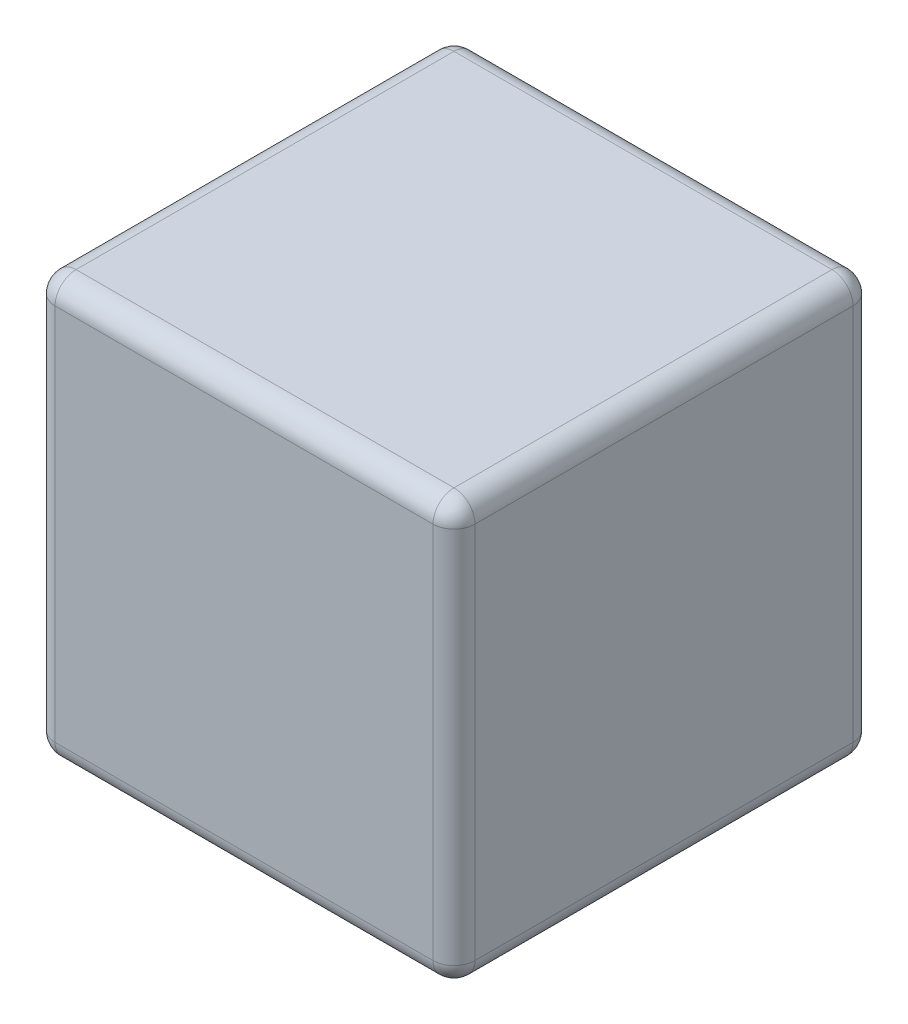
ISO-10303-21;
HEADER;
FILE_DESCRIPTION(('STEP AP214'),'2;1');
FILE_NAME('part.step','',(''),(''),'','','');
FILE_SCHEMA(('AUTOMOTIVE_DESIGN { 1 0 10303 214 1 1 1 1 }'));
ENDSEC;
DATA;
#1=APPLICATION_CONTEXT('core data for automotive mechanical design processes');
#2=APPLICATION_PROTOCOL_DEFINITION('international standard','automotive_design',2000,#1);
#3=PRODUCT_CONTEXT('',#1,'mechanical');
#4=PRODUCT('Part','Part','',(#3));
#5=PRODUCT_RELATED_PRODUCT_CATEGORY('part','',(#4));
#6=PRODUCT_DEFINITION_FORMATION('','',#4);
#7=PRODUCT_DEFINITION_CONTEXT('part definition',#1,'design');
#8=PRODUCT_DEFINITION('design','',#6,#7);
#9=PRODUCT_DEFINITION_SHAPE('','',#8);
#10=(LENGTH_UNIT() NAMED_UNIT(*) SI_UNIT(.MILLI.,.METRE.));
#11=(NAMED_UNIT(*) PLANE_ANGLE_UNIT() SI_UNIT($,.RADIAN.));
#12=(NAMED_UNIT(*) SI_UNIT($,.STERADIAN.) SOLID_ANGLE_UNIT());
#13=UNCERTAINTY_MEASURE_WITH_UNIT(LENGTH_MEASURE(1.E-05),#10,'distance_accuracy_value','');
#14=(GEOMETRIC_REPRESENTATION_CONTEXT(3) GLOBAL_UNCERTAINTY_ASSIGNED_CONTEXT((#13)) GLOBAL_UNIT_ASSIGNED_CONTEXT((#10,
#11,#12)) REPRESENTATION_CONTEXT('',''));
#15=CARTESIAN_POINT('',(0.,0.,0.));
#16=DIRECTION('',(0.,0.,1.));
#17=DIRECTION('',(1.,0.,0.));
#18=AXIS2_PLACEMENT_3D('',#15,#16,#17);
#19=CARTESIAN_POINT('',(0.,0.,10.));
#20=DIRECTION('',(1.,0.,0.));
#21=DIRECTION('',(0.,0.,-1.));
#22=AXIS2_PLACEMENT_3D('',#19,#20,#21);
#23=PLANE('',#22);
#24=DIRECTION('',(0.,-1.,0.));
#25=VECTOR('',#24,1.);
#26=CARTESIAN_POINT('',(0.,0.,0.5));
#27=LINE('',#26,#25);
#28=CARTESIAN_POINT('',(0.,9.5,0.5));
#29=VERTEX_POINT('',#28);
#30=CARTESIAN_POINT('',(0.,0.5,0.5));
#31=VERTEX_POINT('',#30);
#32=EDGE_CURVE('E277',#29,#31,#27,.T.);
#33=ORIENTED_EDGE('',*,*,#32,.T.);
#34=DIRECTION('',(0.,0.,-1.));
#35=VECTOR('',#34,1.);
#36=CARTESIAN_POINT('',(0.,0.5,10.));
#37=LINE('',#36,#35);
#38=CARTESIAN_POINT('',(0.,0.5,9.5));
#39=VERTEX_POINT('',#38);
#40=EDGE_CURVE('E221',#31,#39,#37,.F.);
#41=ORIENTED_EDGE('',*,*,#40,.T.);
#42=DIRECTION('',(0.,-1.,0.));
#43=VECTOR('',#42,1.);
#44=CARTESIAN_POINT('',(0.,0.,9.5));
#45=LINE('',#44,#43);
#46=CARTESIAN_POINT('',(0.,9.5,9.5));
#47=VERTEX_POINT('',#46);
#48=EDGE_CURVE('E226',#39,#47,#45,.F.);
#49=ORIENTED_EDGE('',*,*,#48,.T.);
#50=DIRECTION('',(0.,0.,-1.));
#51=VECTOR('',#50,1.);
#52=CARTESIAN_POINT('',(0.,9.5,10.));
#53=LINE('',#52,#51);
#54=EDGE_CURVE('E309',#47,#29,#53,.T.);
#55=ORIENTED_EDGE('',*,*,#54,.T.);
#56=EDGE_LOOP('',(#33,#41,#49,#55));
#57=FACE_BOUND('',#56,.T.);
#58=ADVANCED_FACE('F35',(#57),#23,.F.);
#59=CARTESIAN_POINT('',(0.,0.,10.));
#60=DIRECTION('',(0.,1.,0.));
#61=DIRECTION('',(0.,0.,1.));
#62=AXIS2_PLACEMENT_3D('',#59,#60,#61);
#63=PLANE('',#62);
#64=DIRECTION('',(1.,0.,0.));
#65=VECTOR('',#64,1.);
#66=CARTESIAN_POINT('',(0.,0.,9.5));
#67=LINE('',#66,#65);
#68=CARTESIAN_POINT('',(9.5,0.,9.5));
#69=VERTEX_POINT('',#68);
#70=CARTESIAN_POINT('',(0.5,0.,9.5));
#71=VERTEX_POINT('',#70);
#72=EDGE_CURVE('E133',#69,#71,#67,.F.);
#73=ORIENTED_EDGE('',*,*,#72,.T.);
#74=DIRECTION('',(0.,0.,-1.));
#75=VECTOR('',#74,1.);
#76=CARTESIAN_POINT('',(0.5,0.,10.));
#77=LINE('',#76,#75);
#78=CARTESIAN_POINT('',(0.5,0.,0.5));
#79=VERTEX_POINT('',#78);
#80=EDGE_CURVE('E129',#71,#79,#77,.T.);
#81=ORIENTED_EDGE('',*,*,#80,.T.);
#82=DIRECTION('',(1.,0.,0.));
#83=VECTOR('',#82,1.);
#84=CARTESIAN_POINT('',(10.,0.,0.5));
#85=LINE('',#84,#83);
#86=CARTESIAN_POINT('',(9.5,0.,0.5));
#87=VERTEX_POINT('',#86);
#88=EDGE_CURVE('E123',#79,#87,#85,.T.);
#89=ORIENTED_EDGE('',*,*,#88,.T.);
#90=DIRECTION('',(0.,0.,-1.));
#91=VECTOR('',#90,1.);
#92=CARTESIAN_POINT('',(9.5,0.,10.));
#93=LINE('',#92,#91);
#94=EDGE_CURVE('E126',#87,#69,#93,.F.);
#95=ORIENTED_EDGE('',*,*,#94,.T.);
#96=EDGE_LOOP('',(#73,#81,#89,#95));
#97=FACE_BOUND('',#96,.T.);
#98=ADVANCED_FACE('F125',(#97),#63,.F.);
#99=CARTESIAN_POINT('',(10.,0.,10.));
#100=DIRECTION('',(-1.,0.,0.));
#101=DIRECTION('',(0.,0.,1.));
#102=AXIS2_PLACEMENT_3D('',#99,#100,#101);
#103=PLANE('',#102);
#104=DIRECTION('',(0.,1.,0.));
#105=VECTOR('',#104,1.);
#106=CARTESIAN_POINT('',(10.,0.,9.5));
#107=LINE('',#106,#105);
#108=CARTESIAN_POINT('',(10.,9.5,9.5));
#109=VERTEX_POINT('',#108);
#110=CARTESIAN_POINT('',(10.,0.5,9.5));
#111=VERTEX_POINT('',#110);
#112=EDGE_CURVE('E245',#109,#111,#107,.F.);
#113=ORIENTED_EDGE('',*,*,#112,.T.);
#114=DIRECTION('',(0.,0.,-1.));
#115=VECTOR('',#114,1.);
#116=CARTESIAN_POINT('',(10.,0.5,10.));
#117=LINE('',#116,#115);
#118=CARTESIAN_POINT('',(10.,0.5,0.5));
#119=VERTEX_POINT('',#118);
#120=EDGE_CURVE('E247',#111,#119,#117,.T.);
#121=ORIENTED_EDGE('',*,*,#120,.T.);
#122=DIRECTION('',(0.,1.,0.));
#123=VECTOR('',#122,1.);
#124=CARTESIAN_POINT('',(10.,10.,0.5));
#125=LINE('',#124,#123);
#126=CARTESIAN_POINT('',(10.,9.5,0.5));
#127=VERTEX_POINT('',#126);
#128=EDGE_CURVE('E243',#119,#127,#125,.T.);
#129=ORIENTED_EDGE('',*,*,#128,.T.);
#130=DIRECTION('',(0.,0.,-1.));
#131=VECTOR('',#130,1.);
#132=CARTESIAN_POINT('',(10.,9.5,10.));
#133=LINE('',#132,#131);
#134=EDGE_CURVE('E241',#127,#109,#133,.F.);
#135=ORIENTED_EDGE('',*,*,#134,.T.);
#136=EDGE_LOOP('',(#113,#121,#129,#135));
#137=FACE_BOUND('',#136,.T.);
#138=ADVANCED_FACE('F297',(#137),#103,.F.);
#139=CARTESIAN_POINT('',(0.,10.,10.));
#140=DIRECTION('',(0.,-1.,0.));
#141=DIRECTION('',(0.,0.,-1.));
#142=AXIS2_PLACEMENT_3D('',#139,#140,#141);
#143=PLANE('',#142);
#144=DIRECTION('',(-1.,0.,0.));
#145=VECTOR('',#144,1.);
#146=CARTESIAN_POINT('',(0.,10.,9.5));
#147=LINE('',#146,#145);
#148=CARTESIAN_POINT('',(0.5,10.,9.5));
#149=VERTEX_POINT('',#148);
#150=CARTESIAN_POINT('',(9.5,10.,9.5));
#151=VERTEX_POINT('',#150);
#152=EDGE_CURVE('E44',#149,#151,#147,.F.);
#153=ORIENTED_EDGE('',*,*,#152,.T.);
#154=DIRECTION('',(0.,0.,-1.));
#155=VECTOR('',#154,1.);
#156=CARTESIAN_POINT('',(9.5,10.,10.));
#157=LINE('',#156,#155);
#158=CARTESIAN_POINT('',(9.5,10.,0.5));
#159=VERTEX_POINT('',#158);
#160=EDGE_CURVE('E11',#151,#159,#157,.T.);
#161=ORIENTED_EDGE('',*,*,#160,.T.);
#162=DIRECTION('',(-1.,0.,0.));
#163=VECTOR('',#162,1.);
#164=CARTESIAN_POINT('',(0.,10.,0.5));
#165=LINE('',#164,#163);
#166=CARTESIAN_POINT('',(0.5,10.,0.5));
#167=VERTEX_POINT('',#166);
#168=EDGE_CURVE('E250',#159,#167,#165,.T.);
#169=ORIENTED_EDGE('',*,*,#168,.T.);
#170=DIRECTION('',(0.,0.,-1.));
#171=VECTOR('',#170,1.);
#172=CARTESIAN_POINT('',(0.5,10.,10.));
#173=LINE('',#172,#171);
#174=EDGE_CURVE('E55',#167,#149,#173,.F.);
#175=ORIENTED_EDGE('',*,*,#174,.T.);
#176=EDGE_LOOP('',(#153,#161,#169,#175));
#177=FACE_BOUND('',#176,.T.);
#178=ADVANCED_FACE('F501',(#177),#143,.F.);
#179=CARTESIAN_POINT('',(0.,0.,10.));
#180=DIRECTION('',(0.,0.,-1.));
#181=DIRECTION('',(-1.,0.,0.));
#182=AXIS2_PLACEMENT_3D('',#179,#180,#181);
#183=PLANE('',#182);
#184=DIRECTION('',(0.,-1.,0.));
#185=VECTOR('',#184,1.);
#186=CARTESIAN_POINT('',(0.5,0.,10.));
#187=LINE('',#186,#185);
#188=CARTESIAN_POINT('',(0.5,9.5,10.));
#189=VERTEX_POINT('',#188);
#190=CARTESIAN_POINT('',(0.5,0.5,10.));
#191=VERTEX_POINT('',#190);
#192=EDGE_CURVE('E223',#189,#191,#187,.T.);
#193=ORIENTED_EDGE('',*,*,#192,.T.);
#194=DIRECTION('',(1.,0.,0.));
#195=VECTOR('',#194,1.);
#196=CARTESIAN_POINT('',(0.,0.5,10.));
#197=LINE('',#196,#195);
#198=CARTESIAN_POINT('',(9.5,0.5,10.));
#199=VERTEX_POINT('',#198);
#200=EDGE_CURVE('E231',#191,#199,#197,.T.);
#201=ORIENTED_EDGE('',*,*,#200,.T.);
#202=DIRECTION('',(0.,1.,0.));
#203=VECTOR('',#202,1.);
#204=CARTESIAN_POINT('',(9.5,0.,10.));
#205=LINE('',#204,#203);
#206=CARTESIAN_POINT('',(9.5,9.5,10.));
#207=VERTEX_POINT('',#206);
#208=EDGE_CURVE('E220',#199,#207,#205,.T.);
#209=ORIENTED_EDGE('',*,*,#208,.T.);
#210=DIRECTION('',(-1.,0.,0.));
#211=VECTOR('',#210,1.);
#212=CARTESIAN_POINT('',(0.,9.5,10.));
#213=LINE('',#212,#211);
#214=EDGE_CURVE('E217',#207,#189,#213,.T.);
#215=ORIENTED_EDGE('',*,*,#214,.T.);
#216=EDGE_LOOP('',(#193,#201,#209,#215));
#217=FACE_BOUND('',#216,.T.);
#218=ADVANCED_FACE('F493',(#217),#183,.F.);
#219=CARTESIAN_POINT('',(0.,0.,0.));
#220=DIRECTION('',(0.,0.,-1.));
#221=DIRECTION('',(-1.,0.,0.));
#222=AXIS2_PLACEMENT_3D('',#219,#220,#221);
#223=PLANE('',#222);
#224=DIRECTION('',(0.,1.,0.));
#225=VECTOR('',#224,1.);
#226=CARTESIAN_POINT('',(9.5,0.,0.));
#227=LINE('',#226,#225);
#228=CARTESIAN_POINT('',(9.5,9.5,0.));
#229=VERTEX_POINT('',#228);
#230=CARTESIAN_POINT('',(9.5,0.5,0.));
#231=VERTEX_POINT('',#230);
#232=EDGE_CURVE('E236',#229,#231,#227,.F.);
#233=ORIENTED_EDGE('',*,*,#232,.T.);
#234=DIRECTION('',(1.,0.,0.));
#235=VECTOR('',#234,1.);
#236=CARTESIAN_POINT('',(0.,0.5,0.));
#237=LINE('',#236,#235);
#238=CARTESIAN_POINT('',(0.5,0.5,0.));
#239=VERTEX_POINT('',#238);
#240=EDGE_CURVE('E156',#231,#239,#237,.F.);
#241=ORIENTED_EDGE('',*,*,#240,.T.);
#242=DIRECTION('',(0.,-1.,0.));
#243=VECTOR('',#242,1.);
#244=CARTESIAN_POINT('',(0.5,10.,0.));
#245=LINE('',#244,#243);
#246=CARTESIAN_POINT('',(0.5,9.5,0.));
#247=VERTEX_POINT('',#246);
#248=EDGE_CURVE('E238',#239,#247,#245,.F.);
#249=ORIENTED_EDGE('',*,*,#248,.T.);
#250=DIRECTION('',(-1.,0.,0.));
#251=VECTOR('',#250,1.);
#252=CARTESIAN_POINT('',(10.,9.5,0.));
#253=LINE('',#252,#251);
#254=EDGE_CURVE('E234',#247,#229,#253,.F.);
#255=ORIENTED_EDGE('',*,*,#254,.T.);
#256=EDGE_LOOP('',(#233,#241,#249,#255));
#257=FACE_BOUND('',#256,.T.);
#258=ADVANCED_FACE('F292',(#257),#223,.T.);
#259=CARTESIAN_POINT('',(9.5,9.5,10.));
#260=DIRECTION('',(0.,0.,-1.));
#261=DIRECTION('',(-1.,0.,0.));
#262=AXIS2_PLACEMENT_3D('',#259,#260,#261);
#263=CYLINDRICAL_SURFACE('',#262,0.5);
#264=CARTESIAN_POINT('',(9.5,9.5,9.5));
#265=DIRECTION('',(0.,0.,1.));
#266=DIRECTION('',(1.,0.,0.));
#267=AXIS2_PLACEMENT_3D('',#264,#265,#266);
#268=CIRCLE('',#267,0.5);
#269=EDGE_CURVE('E39',#109,#151,#268,.T.);
#270=ORIENTED_EDGE('',*,*,#269,.F.);
#271=ORIENTED_EDGE('',*,*,#134,.F.);
#272=CARTESIAN_POINT('',(9.5,9.5,0.5));
#273=DIRECTION('',(0.,0.,-1.));
#274=DIRECTION('',(-1.,0.,0.));
#275=AXIS2_PLACEMENT_3D('',#272,#273,#274);
#276=CIRCLE('',#275,0.5);
#277=EDGE_CURVE('E197',#159,#127,#276,.T.);
#278=ORIENTED_EDGE('',*,*,#277,.F.);
#279=ORIENTED_EDGE('',*,*,#160,.F.);
#280=EDGE_LOOP('',(#270,#271,#278,#279));
#281=FACE_BOUND('',#280,.T.);
#282=ADVANCED_FACE('F37',(#281),#263,.T.);
#283=CARTESIAN_POINT('',(9.5,9.5,9.5));
#284=DIRECTION('',(0.,0.,1.));
#285=DIRECTION('',(1.,0.,0.));
#286=AXIS2_PLACEMENT_3D('',#283,#284,#285);
#287=SPHERICAL_SURFACE('',#286,0.5);
#288=CARTESIAN_POINT('',(9.5,9.5,9.5));
#289=DIRECTION('',(0.,1.,0.));
#290=DIRECTION('',(0.,0.,1.));
#291=AXIS2_PLACEMENT_3D('',#288,#289,#290);
#292=CIRCLE('',#291,0.5);
#293=EDGE_CURVE('E192',#109,#207,#292,.F.);
#294=ORIENTED_EDGE('',*,*,#293,.F.);
#295=ORIENTED_EDGE('',*,*,#269,.T.);
#296=CARTESIAN_POINT('',(9.5,9.5,9.5));
#297=DIRECTION('',(1.,0.,0.));
#298=DIRECTION('',(0.,0.,-1.));
#299=AXIS2_PLACEMENT_3D('',#296,#297,#298);
#300=CIRCLE('',#299,0.5);
#301=EDGE_CURVE('E195',#207,#151,#300,.F.);
#302=ORIENTED_EDGE('',*,*,#301,.F.);
#303=EDGE_LOOP('',(#294,#295,#302));
#304=FACE_BOUND('',#303,.T.);
#305=ADVANCED_FACE('F208',(#304),#287,.T.);
#306=CARTESIAN_POINT('',(9.5,9.5,0.5));
#307=DIRECTION('',(0.,0.,1.));
#308=DIRECTION('',(1.,0.,0.));
#309=AXIS2_PLACEMENT_3D('',#306,#307,#308);
#310=SPHERICAL_SURFACE('',#309,0.5);
#311=CARTESIAN_POINT('',(9.5,9.5,0.5));
#312=DIRECTION('',(1.,0.,0.));
#313=DIRECTION('',(0.,0.,-1.));
#314=AXIS2_PLACEMENT_3D('',#311,#312,#313);
#315=CIRCLE('',#314,0.5);
#316=EDGE_CURVE('E186',#159,#229,#315,.F.);
#317=ORIENTED_EDGE('',*,*,#316,.F.);
#318=ORIENTED_EDGE('',*,*,#277,.T.);
#319=CARTESIAN_POINT('',(9.5,9.5,0.5));
#320=DIRECTION('',(0.,1.,0.));
#321=DIRECTION('',(0.,0.,1.));
#322=AXIS2_PLACEMENT_3D('',#319,#320,#321);
#323=CIRCLE('',#322,0.5);
#324=EDGE_CURVE('E189',#229,#127,#323,.F.);
#325=ORIENTED_EDGE('',*,*,#324,.F.);
#326=EDGE_LOOP('',(#317,#318,#325));
#327=FACE_BOUND('',#326,.T.);
#328=ADVANCED_FACE('F321',(#327),#310,.T.);
#329=CARTESIAN_POINT('',(0.,9.5,9.5));
#330=DIRECTION('',(-1.,0.,0.));
#331=DIRECTION('',(0.,0.,1.));
#332=AXIS2_PLACEMENT_3D('',#329,#330,#331);
#333=CYLINDRICAL_SURFACE('',#332,0.5);
#334=ORIENTED_EDGE('',*,*,#301,.T.);
#335=ORIENTED_EDGE('',*,*,#152,.F.);
#336=CARTESIAN_POINT('',(0.5,9.5,9.5));
#337=DIRECTION('',(-1.,0.,0.));
#338=DIRECTION('',(0.,0.,1.));
#339=AXIS2_PLACEMENT_3D('',#336,#337,#338);
#340=CIRCLE('',#339,0.5);
#341=EDGE_CURVE('E180',#189,#149,#340,.T.);
#342=ORIENTED_EDGE('',*,*,#341,.F.);
#343=ORIENTED_EDGE('',*,*,#214,.F.);
#344=EDGE_LOOP('',(#334,#335,#342,#343));
#345=FACE_BOUND('',#344,.T.);
#346=ADVANCED_FACE('F214',(#345),#333,.T.);
#347=CARTESIAN_POINT('',(9.5,0.,9.5));
#348=DIRECTION('',(0.,1.,0.));
#349=DIRECTION('',(0.,0.,1.));
#350=AXIS2_PLACEMENT_3D('',#347,#348,#349);
#351=CYLINDRICAL_SURFACE('',#350,0.5);
#352=ORIENTED_EDGE('',*,*,#293,.T.);
#353=ORIENTED_EDGE('',*,*,#208,.F.);
#354=CARTESIAN_POINT('',(9.5,0.5,9.5));
#355=DIRECTION('',(0.,-1.,0.));
#356=DIRECTION('',(0.,0.,-1.));
#357=AXIS2_PLACEMENT_3D('',#354,#355,#356);
#358=CIRCLE('',#357,0.5);
#359=EDGE_CURVE('E177',#111,#199,#358,.T.);
#360=ORIENTED_EDGE('',*,*,#359,.F.);
#361=ORIENTED_EDGE('',*,*,#112,.F.);
#362=EDGE_LOOP('',(#352,#353,#360,#361));
#363=FACE_BOUND('',#362,.T.);
#364=ADVANCED_FACE('F301',(#363),#351,.T.);
#365=CARTESIAN_POINT('',(9.5,0.5,10.));
#366=DIRECTION('',(0.,0.,-1.));
#367=DIRECTION('',(-1.,0.,0.));
#368=AXIS2_PLACEMENT_3D('',#365,#366,#367);
#369=CYLINDRICAL_SURFACE('',#368,0.5);
#370=CARTESIAN_POINT('',(9.5,0.5,0.5));
#371=DIRECTION('',(0.,0.,-1.));
#372=DIRECTION('',(-1.,0.,0.));
#373=AXIS2_PLACEMENT_3D('',#370,#371,#372);
#374=CIRCLE('',#373,0.5);
#375=EDGE_CURVE('E140',#119,#87,#374,.T.);
#376=ORIENTED_EDGE('',*,*,#375,.F.);
#377=ORIENTED_EDGE('',*,*,#120,.F.);
#378=CARTESIAN_POINT('',(9.5,0.5,9.5));
#379=DIRECTION('',(0.,0.,1.));
#380=DIRECTION('',(1.,0.,0.));
#381=AXIS2_PLACEMENT_3D('',#378,#379,#380);
#382=CIRCLE('',#381,0.5);
#383=EDGE_CURVE('E143',#69,#111,#382,.T.);
#384=ORIENTED_EDGE('',*,*,#383,.F.);
#385=ORIENTED_EDGE('',*,*,#94,.F.);
#386=EDGE_LOOP('',(#376,#377,#384,#385));
#387=FACE_BOUND('',#386,.T.);
#388=ADVANCED_FACE('F138',(#387),#369,.T.);
#389=CARTESIAN_POINT('',(9.5,0.,0.5));
#390=DIRECTION('',(0.,-1.,0.));
#391=DIRECTION('',(0.,0.,-1.));
#392=AXIS2_PLACEMENT_3D('',#389,#390,#391);
#393=CYLINDRICAL_SURFACE('',#392,0.5);
#394=ORIENTED_EDGE('',*,*,#324,.T.);
#395=ORIENTED_EDGE('',*,*,#128,.F.);
#396=CARTESIAN_POINT('',(9.5,0.5,0.5));
#397=DIRECTION('',(0.,-1.,0.));
#398=DIRECTION('',(0.,0.,-1.));
#399=AXIS2_PLACEMENT_3D('',#396,#397,#398);
#400=CIRCLE('',#399,0.5);
#401=EDGE_CURVE('E152',#231,#119,#400,.T.);
#402=ORIENTED_EDGE('',*,*,#401,.F.);
#403=ORIENTED_EDGE('',*,*,#232,.F.);
#404=EDGE_LOOP('',(#394,#395,#402,#403));
#405=FACE_BOUND('',#404,.T.);
#406=ADVANCED_FACE('F295',(#405),#393,.T.);
#407=CARTESIAN_POINT('',(0.,9.5,0.5));
#408=DIRECTION('',(1.,0.,0.));
#409=DIRECTION('',(0.,0.,-1.));
#410=AXIS2_PLACEMENT_3D('',#407,#408,#409);
#411=CYLINDRICAL_SURFACE('',#410,0.5);
#412=ORIENTED_EDGE('',*,*,#316,.T.);
#413=ORIENTED_EDGE('',*,*,#254,.F.);
#414=CARTESIAN_POINT('',(0.5,9.5,0.5));
#415=DIRECTION('',(-1.,0.,0.));
#416=DIRECTION('',(0.,0.,1.));
#417=AXIS2_PLACEMENT_3D('',#414,#415,#416);
#418=CIRCLE('',#417,0.5);
#419=EDGE_CURVE('E172',#167,#247,#418,.T.);
#420=ORIENTED_EDGE('',*,*,#419,.F.);
#421=ORIENTED_EDGE('',*,*,#168,.F.);
#422=EDGE_LOOP('',(#412,#413,#420,#421));
#423=FACE_BOUND('',#422,.T.);
#424=ADVANCED_FACE('F320',(#423),#411,.T.);
#425=CARTESIAN_POINT('',(0.5,9.5,10.));
#426=DIRECTION('',(0.,0.,-1.));
#427=DIRECTION('',(-1.,0.,0.));
#428=AXIS2_PLACEMENT_3D('',#425,#426,#427);
#429=CYLINDRICAL_SURFACE('',#428,0.5);
#430=CARTESIAN_POINT('',(0.5,9.5,9.5));
#431=DIRECTION('',(0.,0.,1.));
#432=DIRECTION('',(1.,0.,0.));
#433=AXIS2_PLACEMENT_3D('',#430,#431,#432);
#434=CIRCLE('',#433,0.5);
#435=EDGE_CURVE('E183',#149,#47,#434,.T.);
#436=ORIENTED_EDGE('',*,*,#435,.F.);
#437=ORIENTED_EDGE('',*,*,#174,.F.);
#438=CARTESIAN_POINT('',(0.5,9.5,0.5));
#439=DIRECTION('',(0.,0.,-1.));
#440=DIRECTION('',(-1.,0.,0.));
#441=AXIS2_PLACEMENT_3D('',#438,#439,#440);
#442=CIRCLE('',#441,0.5);
#443=EDGE_CURVE('E169',#29,#167,#442,.T.);
#444=ORIENTED_EDGE('',*,*,#443,.F.);
#445=ORIENTED_EDGE('',*,*,#54,.F.);
#446=EDGE_LOOP('',(#436,#437,#444,#445));
#447=FACE_BOUND('',#446,.T.);
#448=ADVANCED_FACE('F315',(#447),#429,.T.);
#449=CARTESIAN_POINT('',(0.5,9.5,9.5));
#450=DIRECTION('',(0.,0.,1.));
#451=DIRECTION('',(1.,0.,0.));
#452=AXIS2_PLACEMENT_3D('',#449,#450,#451);
#453=SPHERICAL_SURFACE('',#452,0.5);
#454=ORIENTED_EDGE('',*,*,#341,.T.);
#455=ORIENTED_EDGE('',*,*,#435,.T.);
#456=CARTESIAN_POINT('',(0.5,9.5,9.5));
#457=DIRECTION('',(0.,1.,0.));
#458=DIRECTION('',(0.,0.,1.));
#459=AXIS2_PLACEMENT_3D('',#456,#457,#458);
#460=CIRCLE('',#459,0.5);
#461=EDGE_CURVE('E160',#189,#47,#460,.F.);
#462=ORIENTED_EDGE('',*,*,#461,.F.);
#463=EDGE_LOOP('',(#454,#455,#462));
#464=FACE_BOUND('',#463,.T.);
#465=ADVANCED_FACE('F357',(#464),#453,.T.);
#466=CARTESIAN_POINT('',(9.5,0.5,9.5));
#467=DIRECTION('',(0.,0.,1.));
#468=DIRECTION('',(1.,0.,0.));
#469=AXIS2_PLACEMENT_3D('',#466,#467,#468);
#470=SPHERICAL_SURFACE('',#469,0.5);
#471=ORIENTED_EDGE('',*,*,#383,.T.);
#472=ORIENTED_EDGE('',*,*,#359,.T.);
#473=CARTESIAN_POINT('',(9.5,0.5,9.5));
#474=DIRECTION('',(1.,0.,0.));
#475=DIRECTION('',(0.,0.,-1.));
#476=AXIS2_PLACEMENT_3D('',#473,#474,#475);
#477=CIRCLE('',#476,0.5);
#478=EDGE_CURVE('E157',#69,#199,#477,.F.);
#479=ORIENTED_EDGE('',*,*,#478,.F.);
#480=EDGE_LOOP('',(#471,#472,#479));
#481=FACE_BOUND('',#480,.T.);
#482=ADVANCED_FACE('F303',(#481),#470,.T.);
#483=CARTESIAN_POINT('',(9.5,0.5,0.5));
#484=DIRECTION('',(0.,0.,1.));
#485=DIRECTION('',(1.,0.,0.));
#486=AXIS2_PLACEMENT_3D('',#483,#484,#485);
#487=SPHERICAL_SURFACE('',#486,0.5);
#488=ORIENTED_EDGE('',*,*,#401,.T.);
#489=ORIENTED_EDGE('',*,*,#375,.T.);
#490=CARTESIAN_POINT('',(9.5,0.5,0.5));
#491=DIRECTION('',(1.,0.,0.));
#492=DIRECTION('',(0.,0.,-1.));
#493=AXIS2_PLACEMENT_3D('',#490,#491,#492);
#494=CIRCLE('',#493,0.5);
#495=EDGE_CURVE('E149',#231,#87,#494,.F.);
#496=ORIENTED_EDGE('',*,*,#495,.F.);
#497=EDGE_LOOP('',(#488,#489,#496));
#498=FACE_BOUND('',#497,.T.);
#499=ADVANCED_FACE('F148',(#498),#487,.T.);
#500=CARTESIAN_POINT('',(0.5,9.5,0.5));
#501=DIRECTION('',(0.,0.,1.));
#502=DIRECTION('',(1.,0.,0.));
#503=AXIS2_PLACEMENT_3D('',#500,#501,#502);
#504=SPHERICAL_SURFACE('',#503,0.5);
#505=ORIENTED_EDGE('',*,*,#443,.T.);
#506=ORIENTED_EDGE('',*,*,#419,.T.);
#507=CARTESIAN_POINT('',(0.5,9.5,0.5));
#508=DIRECTION('',(0.,1.,0.));
#509=DIRECTION('',(0.,0.,1.));
#510=AXIS2_PLACEMENT_3D('',#507,#508,#509);
#511=CIRCLE('',#510,0.5);
#512=EDGE_CURVE('E158',#29,#247,#511,.F.);
#513=ORIENTED_EDGE('',*,*,#512,.F.);
#514=EDGE_LOOP('',(#505,#506,#513));
#515=FACE_BOUND('',#514,.T.);
#516=ADVANCED_FACE('F318',(#515),#504,.T.);
#517=CARTESIAN_POINT('',(0.5,0.,9.5));
#518=DIRECTION('',(0.,-1.,0.));
#519=DIRECTION('',(0.,0.,-1.));
#520=AXIS2_PLACEMENT_3D('',#517,#518,#519);
#521=CYLINDRICAL_SURFACE('',#520,0.5);
#522=ORIENTED_EDGE('',*,*,#461,.T.);
#523=ORIENTED_EDGE('',*,*,#48,.F.);
#524=CARTESIAN_POINT('',(0.5,0.5,9.5));
#525=DIRECTION('',(0.,-1.,0.));
#526=DIRECTION('',(0.,0.,-1.));
#527=AXIS2_PLACEMENT_3D('',#524,#525,#526);
#528=CIRCLE('',#527,0.5);
#529=EDGE_CURVE('E163',#191,#39,#528,.T.);
#530=ORIENTED_EDGE('',*,*,#529,.F.);
#531=ORIENTED_EDGE('',*,*,#192,.F.);
#532=EDGE_LOOP('',(#522,#523,#530,#531));
#533=FACE_BOUND('',#532,.T.);
#534=ADVANCED_FACE('F274',(#533),#521,.T.);
#535=CARTESIAN_POINT('',(0.,0.5,9.5));
#536=DIRECTION('',(1.,0.,0.));
#537=DIRECTION('',(0.,0.,-1.));
#538=AXIS2_PLACEMENT_3D('',#535,#536,#537);
#539=CYLINDRICAL_SURFACE('',#538,0.5);
#540=ORIENTED_EDGE('',*,*,#478,.T.);
#541=ORIENTED_EDGE('',*,*,#200,.F.);
#542=CARTESIAN_POINT('',(0.5,0.5,9.5));
#543=DIRECTION('',(-1.,0.,0.));
#544=DIRECTION('',(0.,0.,1.));
#545=AXIS2_PLACEMENT_3D('',#542,#543,#544);
#546=CIRCLE('',#545,0.5);
#547=EDGE_CURVE('E263',#71,#191,#546,.T.);
#548=ORIENTED_EDGE('',*,*,#547,.F.);
#549=ORIENTED_EDGE('',*,*,#72,.F.);
#550=EDGE_LOOP('',(#540,#541,#548,#549));
#551=FACE_BOUND('',#550,.T.);
#552=ADVANCED_FACE('F307',(#551),#539,.T.);
#553=CARTESIAN_POINT('',(0.,0.5,0.5));
#554=DIRECTION('',(-1.,0.,0.));
#555=DIRECTION('',(0.,0.,1.));
#556=AXIS2_PLACEMENT_3D('',#553,#554,#555);
#557=CYLINDRICAL_SURFACE('',#556,0.5);
#558=ORIENTED_EDGE('',*,*,#495,.T.);
#559=ORIENTED_EDGE('',*,*,#88,.F.);
#560=CARTESIAN_POINT('',(0.5,0.5,0.5));
#561=DIRECTION('',(-1.,0.,0.));
#562=DIRECTION('',(0.,0.,1.));
#563=AXIS2_PLACEMENT_3D('',#560,#561,#562);
#564=CIRCLE('',#563,0.5);
#565=EDGE_CURVE('E260',#239,#79,#564,.T.);
#566=ORIENTED_EDGE('',*,*,#565,.F.);
#567=ORIENTED_EDGE('',*,*,#240,.F.);
#568=EDGE_LOOP('',(#558,#559,#566,#567));
#569=FACE_BOUND('',#568,.T.);
#570=ADVANCED_FACE('F154',(#569),#557,.T.);
#571=CARTESIAN_POINT('',(0.5,0.,0.5));
#572=DIRECTION('',(0.,1.,0.));
#573=DIRECTION('',(0.,0.,1.));
#574=AXIS2_PLACEMENT_3D('',#571,#572,#573);
#575=CYLINDRICAL_SURFACE('',#574,0.5);
#576=ORIENTED_EDGE('',*,*,#512,.T.);
#577=ORIENTED_EDGE('',*,*,#248,.F.);
#578=CARTESIAN_POINT('',(0.5,0.5,0.5));
#579=DIRECTION('',(0.,-1.,0.));
#580=DIRECTION('',(0.,0.,-1.));
#581=AXIS2_PLACEMENT_3D('',#578,#579,#580);
#582=CIRCLE('',#581,0.5);
#583=EDGE_CURVE('E258',#31,#239,#582,.T.);
#584=ORIENTED_EDGE('',*,*,#583,.F.);
#585=ORIENTED_EDGE('',*,*,#32,.F.);
#586=EDGE_LOOP('',(#576,#577,#584,#585));
#587=FACE_BOUND('',#586,.T.);
#588=ADVANCED_FACE('F288',(#587),#575,.T.);
#589=CARTESIAN_POINT('',(0.5,0.5,9.5));
#590=DIRECTION('',(0.,0.,1.));
#591=DIRECTION('',(1.,0.,0.));
#592=AXIS2_PLACEMENT_3D('',#589,#590,#591);
#593=SPHERICAL_SURFACE('',#592,0.5);
#594=ORIENTED_EDGE('',*,*,#547,.T.);
#595=ORIENTED_EDGE('',*,*,#529,.T.);
#596=CARTESIAN_POINT('',(0.5,0.5,9.5));
#597=DIRECTION('',(0.,0.,1.));
#598=DIRECTION('',(1.,0.,0.));
#599=AXIS2_PLACEMENT_3D('',#596,#597,#598);
#600=CIRCLE('',#599,0.5);
#601=EDGE_CURVE('E256',#71,#39,#600,.F.);
#602=ORIENTED_EDGE('',*,*,#601,.F.);
#603=EDGE_LOOP('',(#594,#595,#602));
#604=FACE_BOUND('',#603,.T.);
#605=ADVANCED_FACE('F270',(#604),#593,.T.);
#606=CARTESIAN_POINT('',(0.5,0.5,0.5));
#607=DIRECTION('',(0.,0.,1.));
#608=DIRECTION('',(1.,0.,0.));
#609=AXIS2_PLACEMENT_3D('',#606,#607,#608);
#610=SPHERICAL_SURFACE('',#609,0.5);
#611=ORIENTED_EDGE('',*,*,#583,.T.);
#612=ORIENTED_EDGE('',*,*,#565,.T.);
#613=CARTESIAN_POINT('',(0.5,0.5,0.5));
#614=DIRECTION('',(0.,0.,-1.));
#615=DIRECTION('',(-1.,0.,0.));
#616=AXIS2_PLACEMENT_3D('',#613,#614,#615);
#617=CIRCLE('',#616,0.5);
#618=EDGE_CURVE('E254',#31,#79,#617,.F.);
#619=ORIENTED_EDGE('',*,*,#618,.F.);
#620=EDGE_LOOP('',(#611,#612,#619));
#621=FACE_BOUND('',#620,.T.);
#622=ADVANCED_FACE('F285',(#621),#610,.T.);
#623=CARTESIAN_POINT('',(0.5,0.5,10.));
#624=DIRECTION('',(0.,0.,-1.));
#625=DIRECTION('',(-1.,0.,0.));
#626=AXIS2_PLACEMENT_3D('',#623,#624,#625);
#627=CYLINDRICAL_SURFACE('',#626,0.5);
#628=ORIENTED_EDGE('',*,*,#601,.T.);
#629=ORIENTED_EDGE('',*,*,#40,.F.);
#630=ORIENTED_EDGE('',*,*,#618,.T.);
#631=ORIENTED_EDGE('',*,*,#80,.F.);
#632=EDGE_LOOP('',(#628,#629,#630,#631));
#633=FACE_BOUND('',#632,.T.);
#634=ADVANCED_FACE('F283',(#633),#627,.T.);
#635=CLOSED_SHELL('',(#58,#98,#138,#178,#218,#258,#282,#305,#328,#346,#364,#388,#406,#424,#448,
#465,#482,#499,#516,#534,#552,#570,#588,#605,#622,#634));
#636=MANIFOLD_SOLID_BREP('B2',#635);
#637=ADVANCED_BREP_SHAPE_REPRESENTATION('',(#18,#636),#14);
#638=SHAPE_DEFINITION_REPRESENTATION(#9,#637);
ENDSEC;
END-ISO-10303-21;
